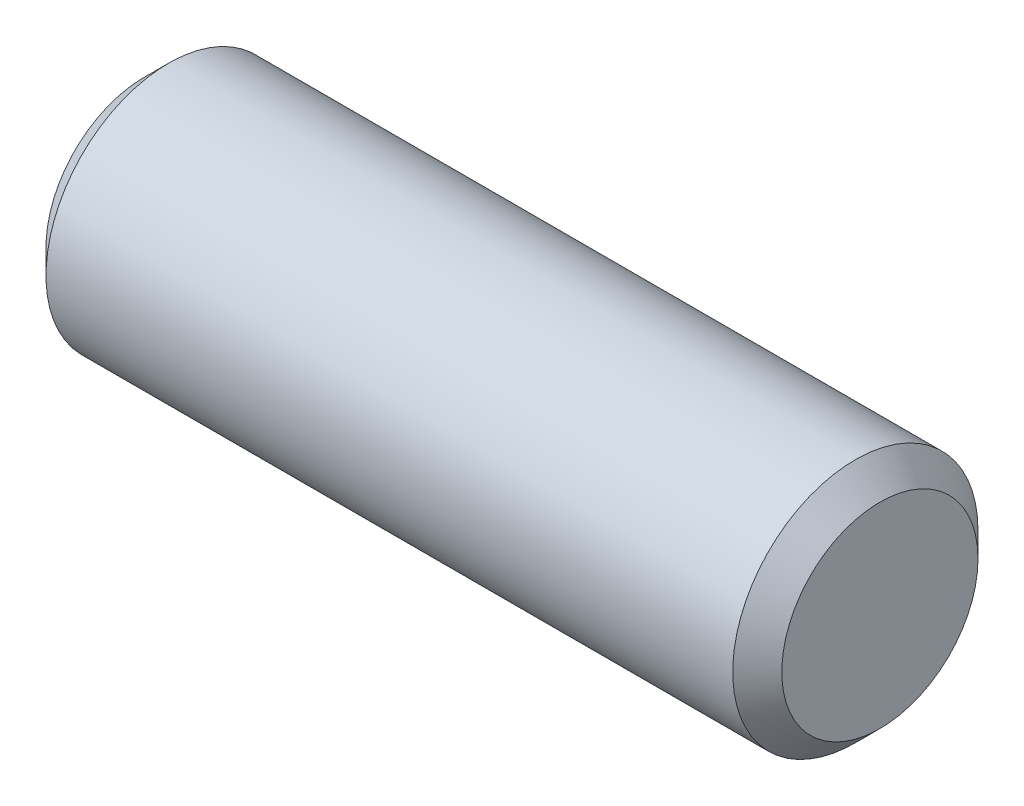
ISO-10303-21;
HEADER;
FILE_DESCRIPTION(('STEP AP214'),'2;1');
FILE_NAME('part.step','',(''),(''),'','','');
FILE_SCHEMA(('AUTOMOTIVE_DESIGN { 1 0 10303 214 1 1 1 1 }'));
ENDSEC;
DATA;
#1=APPLICATION_CONTEXT('core data for automotive mechanical design processes');
#2=APPLICATION_PROTOCOL_DEFINITION('international standard','automotive_design',2000,#1);
#3=PRODUCT_CONTEXT('',#1,'mechanical');
#4=PRODUCT('Part','Part','',(#3));
#5=PRODUCT_RELATED_PRODUCT_CATEGORY('part','',(#4));
#6=PRODUCT_DEFINITION_FORMATION('','',#4);
#7=PRODUCT_DEFINITION_CONTEXT('part definition',#1,'design');
#8=PRODUCT_DEFINITION('design','',#6,#7);
#9=PRODUCT_DEFINITION_SHAPE('','',#8);
#10=(LENGTH_UNIT() NAMED_UNIT(*) SI_UNIT(.MILLI.,.METRE.));
#11=(NAMED_UNIT(*) PLANE_ANGLE_UNIT() SI_UNIT($,.RADIAN.));
#12=(NAMED_UNIT(*) SI_UNIT($,.STERADIAN.) SOLID_ANGLE_UNIT());
#13=UNCERTAINTY_MEASURE_WITH_UNIT(LENGTH_MEASURE(1.E-05),#10,'distance_accuracy_value','');
#14=(GEOMETRIC_REPRESENTATION_CONTEXT(3) GLOBAL_UNCERTAINTY_ASSIGNED_CONTEXT((#13)) GLOBAL_UNIT_ASSIGNED_CONTEXT((#10,
#11,#12)) REPRESENTATION_CONTEXT('',''));
#15=CARTESIAN_POINT('',(0.,0.,0.));
#16=DIRECTION('',(0.,0.,1.));
#17=DIRECTION('',(1.,0.,0.));
#18=AXIS2_PLACEMENT_3D('',#15,#16,#17);
#19=CARTESIAN_POINT('',(-4.7625,0.,0.));
#20=DIRECTION('',(1.,0.,0.));
#21=DIRECTION('',(0.,0.,-1.));
#22=AXIS2_PLACEMENT_3D('',#19,#20,#21);
#23=CYLINDRICAL_SURFACE('',#22,1.5875);
#24=CARTESIAN_POINT('',(4.445,0.,0.));
#25=DIRECTION('',(1.,0.,0.));
#26=DIRECTION('',(0.,0.,-1.));
#27=AXIS2_PLACEMENT_3D('',#24,#25,#26);
#28=CIRCLE('',#27,1.5875);
#29=CARTESIAN_POINT('',(4.445,0.,-1.5875));
#30=VERTEX_POINT('',#29);
#31=EDGE_CURVE('E37',#30,#30,#28,.F.);
#32=ORIENTED_EDGE('',*,*,#31,.T.);
#33=EDGE_LOOP('',(#32));
#34=FACE_BOUND('',#33,.T.);
#35=CARTESIAN_POINT('',(-4.445,0.,0.));
#36=DIRECTION('',(1.,0.,0.));
#37=DIRECTION('',(0.,0.,-1.));
#38=AXIS2_PLACEMENT_3D('',#35,#36,#37);
#39=CIRCLE('',#38,1.5875);
#40=CARTESIAN_POINT('',(-4.445,0.,-1.5875));
#41=VERTEX_POINT('',#40);
#42=EDGE_CURVE('E41',#41,#41,#39,.T.);
#43=ORIENTED_EDGE('',*,*,#42,.T.);
#44=EDGE_LOOP('',(#43));
#45=FACE_BOUND('',#44,.T.);
#46=ADVANCED_FACE('F30',(#34,#45),#23,.T.);
#47=CARTESIAN_POINT('',(-4.7625,0.,0.));
#48=DIRECTION('',(1.,0.,0.));
#49=DIRECTION('',(0.,0.,-1.));
#50=AXIS2_PLACEMENT_3D('',#47,#48,#49);
#51=PLANE('',#50);
#52=CARTESIAN_POINT('',(-4.7625,0.,0.));
#53=DIRECTION('',(1.,0.,0.));
#54=DIRECTION('',(0.,0.,-1.));
#55=AXIS2_PLACEMENT_3D('',#52,#53,#54);
#56=CIRCLE('',#55,1.27);
#57=CARTESIAN_POINT('',(-4.7625,0.,-1.27));
#58=VERTEX_POINT('',#57);
#59=EDGE_CURVE('E10',#58,#58,#56,.F.);
#60=ORIENTED_EDGE('',*,*,#59,.T.);
#61=EDGE_LOOP('',(#60));
#62=FACE_BOUND('',#61,.T.);
#63=ADVANCED_FACE('F61',(#62),#51,.F.);
#64=CARTESIAN_POINT('',(4.7625,0.,0.));
#65=DIRECTION('',(1.,0.,0.));
#66=DIRECTION('',(0.,0.,-1.));
#67=AXIS2_PLACEMENT_3D('',#64,#65,#66);
#68=PLANE('',#67);
#69=CARTESIAN_POINT('',(4.7625,0.,0.));
#70=DIRECTION('',(1.,0.,0.));
#71=DIRECTION('',(0.,0.,-1.));
#72=AXIS2_PLACEMENT_3D('',#69,#70,#71);
#73=CIRCLE('',#72,1.27);
#74=CARTESIAN_POINT('',(4.7625,0.,-1.27));
#75=VERTEX_POINT('',#74);
#76=EDGE_CURVE('E45',#75,#75,#73,.T.);
#77=ORIENTED_EDGE('',*,*,#76,.T.);
#78=EDGE_LOOP('',(#77));
#79=FACE_BOUND('',#78,.T.);
#80=ADVANCED_FACE('F51',(#79),#68,.T.);
#81=CARTESIAN_POINT('',(4.7625,0.,0.));
#82=DIRECTION('',(-1.,0.,0.));
#83=DIRECTION('',(0.,0.,1.));
#84=AXIS2_PLACEMENT_3D('',#81,#82,#83);
#85=CONICAL_SURFACE('',#84,1.27,0.78539816339745);
#86=ORIENTED_EDGE('',*,*,#31,.F.);
#87=EDGE_LOOP('',(#86));
#88=FACE_BOUND('',#87,.T.);
#89=ORIENTED_EDGE('',*,*,#76,.F.);
#90=EDGE_LOOP('',(#89));
#91=FACE_BOUND('',#90,.T.);
#92=ADVANCED_FACE('F53',(#88,#91),#85,.T.);
#93=CARTESIAN_POINT('',(-4.445,0.,0.));
#94=DIRECTION('',(1.,0.,0.));
#95=DIRECTION('',(0.,0.,-1.));
#96=AXIS2_PLACEMENT_3D('',#93,#94,#95);
#97=CONICAL_SURFACE('',#96,1.5875,0.785398163397448);
#98=ORIENTED_EDGE('',*,*,#59,.F.);
#99=EDGE_LOOP('',(#98));
#100=FACE_BOUND('',#99,.T.);
#101=ORIENTED_EDGE('',*,*,#42,.F.);
#102=EDGE_LOOP('',(#101));
#103=FACE_BOUND('',#102,.T.);
#104=ADVANCED_FACE('F32',(#100,#103),#97,.T.);
#105=CLOSED_SHELL('',(#46,#63,#80,#92,#104));
#106=MANIFOLD_SOLID_BREP('B2',#105);
#107=ADVANCED_BREP_SHAPE_REPRESENTATION('',(#18,#106),#14);
#108=SHAPE_DEFINITION_REPRESENTATION(#9,#107);
ENDSEC;
END-ISO-10303-21;
